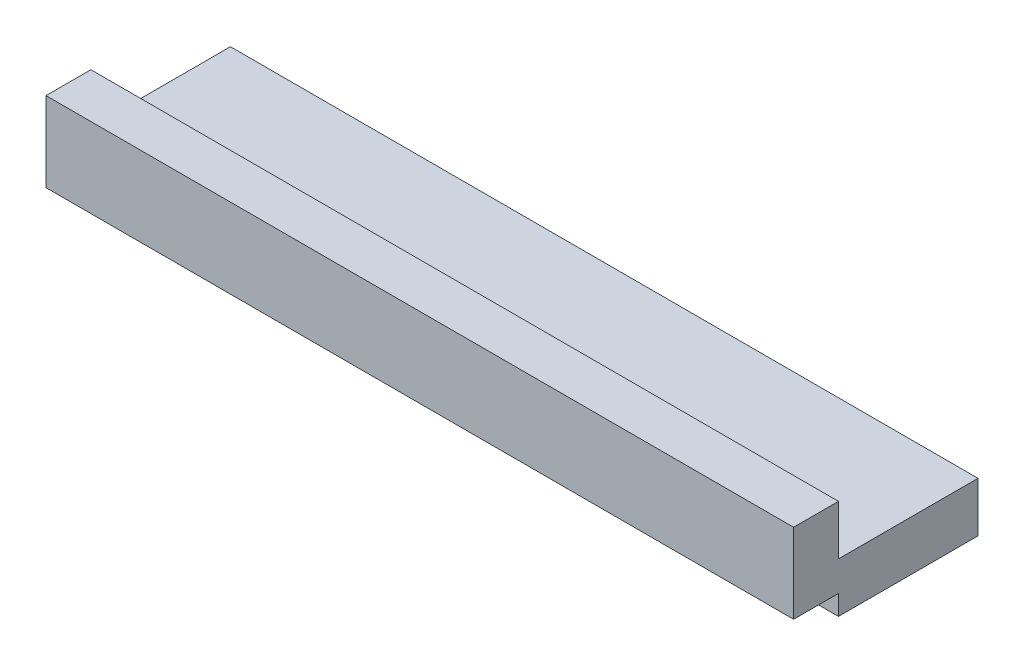
ISO-10303-21;
HEADER;
FILE_DESCRIPTION(('STEP AP214'),'2;1');
FILE_NAME('part.step','',(''),(''),'','','');
FILE_SCHEMA(('AUTOMOTIVE_DESIGN { 1 0 10303 214 1 1 1 1 }'));
ENDSEC;
DATA;
#1=APPLICATION_CONTEXT('core data for automotive mechanical design processes');
#2=APPLICATION_PROTOCOL_DEFINITION('international standard','automotive_design',2000,#1);
#3=PRODUCT_CONTEXT('',#1,'mechanical');
#4=PRODUCT('Part','Part','',(#3));
#5=PRODUCT_RELATED_PRODUCT_CATEGORY('part','',(#4));
#6=PRODUCT_DEFINITION_FORMATION('','',#4);
#7=PRODUCT_DEFINITION_CONTEXT('part definition',#1,'design');
#8=PRODUCT_DEFINITION('design','',#6,#7);
#9=PRODUCT_DEFINITION_SHAPE('','',#8);
#10=(LENGTH_UNIT() NAMED_UNIT(*) SI_UNIT(.MILLI.,.METRE.));
#11=(NAMED_UNIT(*) PLANE_ANGLE_UNIT() SI_UNIT($,.RADIAN.));
#12=(NAMED_UNIT(*) SI_UNIT($,.STERADIAN.) SOLID_ANGLE_UNIT());
#13=UNCERTAINTY_MEASURE_WITH_UNIT(LENGTH_MEASURE(1.E-05),#10,'distance_accuracy_value','');
#14=(GEOMETRIC_REPRESENTATION_CONTEXT(3) GLOBAL_UNCERTAINTY_ASSIGNED_CONTEXT((#13)) GLOBAL_UNIT_ASSIGNED_CONTEXT((#10,
#11,#12)) REPRESENTATION_CONTEXT('',''));
#15=CARTESIAN_POINT('',(0.,0.,0.));
#16=DIRECTION('',(0.,0.,1.));
#17=DIRECTION('',(1.,0.,0.));
#18=AXIS2_PLACEMENT_3D('',#15,#16,#17);
#19=CARTESIAN_POINT('',(0.,0.,-2.6939393939394));
#20=DIRECTION('',(0.,0.,1.));
#21=DIRECTION('',(1.,0.,0.));
#22=AXIS2_PLACEMENT_3D('',#19,#20,#21);
#23=PLANE('',#22);
#24=DIRECTION('',(-1.,0.,0.));
#25=VECTOR('',#24,1.);
#26=CARTESIAN_POINT('',(-27.7860606060606,0.,-2.6939393939394));
#27=LINE('',#26,#25);
#28=CARTESIAN_POINT('',(10.3139393939394,0.,-2.6939393939394));
#29=VERTEX_POINT('',#28);
#30=CARTESIAN_POINT('',(2.94793939393943,0.,-2.6939393939394));
#31=VERTEX_POINT('',#30);
#32=EDGE_CURVE('E119',#29,#31,#27,.T.);
#33=ORIENTED_EDGE('',*,*,#32,.T.);
#34=DIRECTION('',(0.,1.,0.));
#35=VECTOR('',#34,1.);
#36=CARTESIAN_POINT('',(2.94793939393943,-1.016,-2.6939393939394));
#37=LINE('',#36,#35);
#38=CARTESIAN_POINT('',(2.94793939393943,-1.016,-2.6939393939394));
#39=VERTEX_POINT('',#38);
#40=EDGE_CURVE('E125',#39,#31,#37,.T.);
#41=ORIENTED_EDGE('',*,*,#40,.F.);
#42=DIRECTION('',(-1.,0.,0.));
#43=VECTOR('',#42,1.);
#44=CARTESIAN_POINT('',(-27.7860606060606,-1.016,-2.6939393939394));
#45=LINE('',#44,#43);
#46=CARTESIAN_POINT('',(10.3139393939394,-1.016,-2.6939393939394));
#47=VERTEX_POINT('',#46);
#48=EDGE_CURVE('E181',#47,#39,#45,.T.);
#49=ORIENTED_EDGE('',*,*,#48,.F.);
#50=DIRECTION('',(0.,-1.,0.));
#51=VECTOR('',#50,1.);
#52=CARTESIAN_POINT('',(10.3139393939394,1.524,-2.6939393939394));
#53=LINE('',#52,#51);
#54=EDGE_CURVE('E133',#29,#47,#53,.T.);
#55=ORIENTED_EDGE('',*,*,#54,.F.);
#56=EDGE_LOOP('',(#33,#41,#49,#55));
#57=FACE_BOUND('',#56,.T.);
#58=ADVANCED_FACE('F35',(#57),#23,.T.);
#59=CARTESIAN_POINT('',(-27.7860606060606,4.064,-2.6939393939394));
#60=DIRECTION('',(0.,0.,1.));
#61=DIRECTION('',(1.,0.,0.));
#62=AXIS2_PLACEMENT_3D('',#59,#60,#61);
#63=PLANE('',#62);
#64=DIRECTION('',(1.,0.,0.));
#65=VECTOR('',#64,1.);
#66=CARTESIAN_POINT('',(-27.7860606060606,1.524,-2.6939393939394));
#67=LINE('',#66,#65);
#68=CARTESIAN_POINT('',(-27.7860606060606,1.524,-2.6939393939394));
#69=VERTEX_POINT('',#68);
#70=CARTESIAN_POINT('',(10.3139393939394,1.524,-2.6939393939394));
#71=VERTEX_POINT('',#70);
#72=EDGE_CURVE('E58',#69,#71,#67,.T.);
#73=ORIENTED_EDGE('',*,*,#72,.F.);
#74=DIRECTION('',(0.,-1.,0.));
#75=VECTOR('',#74,1.);
#76=CARTESIAN_POINT('',(-27.7860606060606,4.064,-2.6939393939394));
#77=LINE('',#76,#75);
#78=CARTESIAN_POINT('',(-27.7860606060606,4.064,-2.6939393939394));
#79=VERTEX_POINT('',#78);
#80=EDGE_CURVE('E144',#79,#69,#77,.T.);
#81=ORIENTED_EDGE('',*,*,#80,.F.);
#82=DIRECTION('',(-1.,0.,0.));
#83=VECTOR('',#82,1.);
#84=CARTESIAN_POINT('',(-27.7860606060606,4.064,-2.6939393939394));
#85=LINE('',#84,#83);
#86=CARTESIAN_POINT('',(10.3139393939394,4.064,-2.6939393939394));
#87=VERTEX_POINT('',#86);
#88=EDGE_CURVE('E147',#87,#79,#85,.T.);
#89=ORIENTED_EDGE('',*,*,#88,.F.);
#90=DIRECTION('',(0.,-1.,0.));
#91=VECTOR('',#90,1.);
#92=CARTESIAN_POINT('',(10.3139393939394,4.064,-2.6939393939394));
#93=LINE('',#92,#91);
#94=EDGE_CURVE('E146',#87,#71,#93,.T.);
#95=ORIENTED_EDGE('',*,*,#94,.T.);
#96=EDGE_LOOP('',(#73,#81,#89,#95));
#97=FACE_BOUND('',#96,.T.);
#98=ADVANCED_FACE('F214',(#97),#63,.F.);
#99=CARTESIAN_POINT('',(-27.7860606060606,4.064,-0.407939393939396));
#100=DIRECTION('',(1.,0.,0.));
#101=DIRECTION('',(0.,0.,-1.));
#102=AXIS2_PLACEMENT_3D('',#99,#100,#101);
#103=PLANE('',#102);
#104=DIRECTION('',(0.,0.,1.));
#105=VECTOR('',#104,1.);
#106=CARTESIAN_POINT('',(-27.7860606060606,-1.016,-9.8059393939394));
#107=LINE('',#106,#105);
#108=CARTESIAN_POINT('',(-27.7860606060606,-1.016,-9.8059393939394));
#109=VERTEX_POINT('',#108);
#110=CARTESIAN_POINT('',(-27.7860606060606,-1.016,-3.4559393939394));
#111=VERTEX_POINT('',#110);
#112=EDGE_CURVE('E178',#109,#111,#107,.T.);
#113=ORIENTED_EDGE('',*,*,#112,.T.);
#114=DIRECTION('',(0.,-1.,0.));
#115=VECTOR('',#114,1.);
#116=CARTESIAN_POINT('',(-27.7860606060606,-1.016,-3.4559393939394));
#117=LINE('',#116,#115);
#118=CARTESIAN_POINT('',(-27.7860606060606,0.,-3.4559393939394));
#119=VERTEX_POINT('',#118);
#120=EDGE_CURVE('E131',#119,#111,#117,.T.);
#121=ORIENTED_EDGE('',*,*,#120,.F.);
#122=DIRECTION('',(0.,0.,1.));
#123=VECTOR('',#122,1.);
#124=CARTESIAN_POINT('',(-27.7860606060606,0.,-0.407939393939396));
#125=LINE('',#124,#123);
#126=CARTESIAN_POINT('',(-27.7860606060606,0.,-0.407939393939396));
#127=VERTEX_POINT('',#126);
#128=EDGE_CURVE('E157',#119,#127,#125,.T.);
#129=ORIENTED_EDGE('',*,*,#128,.T.);
#130=DIRECTION('',(0.,-1.,0.));
#131=VECTOR('',#130,1.);
#132=CARTESIAN_POINT('',(-27.7860606060606,4.064,-0.407939393939396));
#133=LINE('',#132,#131);
#134=CARTESIAN_POINT('',(-27.7860606060606,4.064,-0.407939393939396));
#135=VERTEX_POINT('',#134);
#136=EDGE_CURVE('E11',#135,#127,#133,.T.);
#137=ORIENTED_EDGE('',*,*,#136,.F.);
#138=DIRECTION('',(0.,0.,1.));
#139=VECTOR('',#138,1.);
#140=CARTESIAN_POINT('',(-27.7860606060606,4.064,-0.407939393939396));
#141=LINE('',#140,#139);
#142=EDGE_CURVE('E134',#79,#135,#141,.T.);
#143=ORIENTED_EDGE('',*,*,#142,.F.);
#144=ORIENTED_EDGE('',*,*,#80,.T.);
#145=DIRECTION('',(0.,0.,1.));
#146=VECTOR('',#145,1.);
#147=CARTESIAN_POINT('',(-27.7860606060606,1.524,-9.8059393939394));
#148=LINE('',#147,#146);
#149=CARTESIAN_POINT('',(-27.7860606060606,1.524,-9.8059393939394));
#150=VERTEX_POINT('',#149);
#151=EDGE_CURVE('E164',#150,#69,#148,.T.);
#152=ORIENTED_EDGE('',*,*,#151,.F.);
#153=DIRECTION('',(0.,1.,0.));
#154=VECTOR('',#153,1.);
#155=CARTESIAN_POINT('',(-27.7860606060606,1.524,-9.8059393939394));
#156=LINE('',#155,#154);
#157=EDGE_CURVE('E183',#109,#150,#156,.T.);
#158=ORIENTED_EDGE('',*,*,#157,.F.);
#159=EDGE_LOOP('',(#113,#121,#129,#137,#143,#144,#152,#158));
#160=FACE_BOUND('',#159,.T.);
#161=ADVANCED_FACE('F37',(#160),#103,.F.);
#162=CARTESIAN_POINT('',(-27.7860606060606,4.064,-0.407939393939396));
#163=DIRECTION('',(0.,0.,-1.));
#164=DIRECTION('',(-1.,0.,0.));
#165=AXIS2_PLACEMENT_3D('',#162,#163,#164);
#166=PLANE('',#165);
#167=DIRECTION('',(1.,0.,0.));
#168=VECTOR('',#167,1.);
#169=CARTESIAN_POINT('',(-27.7860606060606,0.,-0.407939393939396));
#170=LINE('',#169,#168);
#171=CARTESIAN_POINT('',(10.3139393939394,0.,-0.407939393939396));
#172=VERTEX_POINT('',#171);
#173=EDGE_CURVE('E140',#127,#172,#170,.T.);
#174=ORIENTED_EDGE('',*,*,#173,.T.);
#175=DIRECTION('',(0.,-1.,0.));
#176=VECTOR('',#175,1.);
#177=CARTESIAN_POINT('',(10.3139393939394,4.064,-0.407939393939396));
#178=LINE('',#177,#176);
#179=CARTESIAN_POINT('',(10.3139393939394,4.064,-0.407939393939396));
#180=VERTEX_POINT('',#179);
#181=EDGE_CURVE('E43',#180,#172,#178,.T.);
#182=ORIENTED_EDGE('',*,*,#181,.F.);
#183=DIRECTION('',(1.,0.,0.));
#184=VECTOR('',#183,1.);
#185=CARTESIAN_POINT('',(-27.7860606060606,4.064,-0.407939393939396));
#186=LINE('',#185,#184);
#187=EDGE_CURVE('E138',#135,#180,#186,.T.);
#188=ORIENTED_EDGE('',*,*,#187,.F.);
#189=ORIENTED_EDGE('',*,*,#136,.T.);
#190=EDGE_LOOP('',(#174,#182,#188,#189));
#191=FACE_BOUND('',#190,.T.);
#192=ADVANCED_FACE('F159',(#191),#166,.F.);
#193=CARTESIAN_POINT('',(10.3139393939394,4.064,-0.407939393939396));
#194=DIRECTION('',(-1.,0.,0.));
#195=DIRECTION('',(0.,0.,1.));
#196=AXIS2_PLACEMENT_3D('',#193,#194,#195);
#197=PLANE('',#196);
#198=DIRECTION('',(0.,0.,-1.));
#199=VECTOR('',#198,1.);
#200=CARTESIAN_POINT('',(10.3139393939394,0.,-0.407939393939396));
#201=LINE('',#200,#199);
#202=EDGE_CURVE('E135',#172,#29,#201,.T.);
#203=ORIENTED_EDGE('',*,*,#202,.T.);
#204=ORIENTED_EDGE('',*,*,#54,.T.);
#205=DIRECTION('',(0.,0.,1.));
#206=VECTOR('',#205,1.);
#207=CARTESIAN_POINT('',(10.3139393939394,-1.016,-9.8059393939394));
#208=LINE('',#207,#206);
#209=CARTESIAN_POINT('',(10.3139393939394,-1.016,-9.8059393939394));
#210=VERTEX_POINT('',#209);
#211=EDGE_CURVE('E175',#210,#47,#208,.T.);
#212=ORIENTED_EDGE('',*,*,#211,.F.);
#213=DIRECTION('',(0.,-1.,0.));
#214=VECTOR('',#213,1.);
#215=CARTESIAN_POINT('',(10.3139393939394,1.524,-9.8059393939394));
#216=LINE('',#215,#214);
#217=CARTESIAN_POINT('',(10.3139393939394,1.524,-9.8059393939394));
#218=VERTEX_POINT('',#217);
#219=EDGE_CURVE('E188',#218,#210,#216,.T.);
#220=ORIENTED_EDGE('',*,*,#219,.F.);
#221=DIRECTION('',(0.,0.,1.));
#222=VECTOR('',#221,1.);
#223=CARTESIAN_POINT('',(10.3139393939394,1.524,-9.8059393939394));
#224=LINE('',#223,#222);
#225=EDGE_CURVE('E167',#218,#71,#224,.T.);
#226=ORIENTED_EDGE('',*,*,#225,.T.);
#227=ORIENTED_EDGE('',*,*,#94,.F.);
#228=DIRECTION('',(0.,0.,-1.));
#229=VECTOR('',#228,1.);
#230=CARTESIAN_POINT('',(10.3139393939394,4.064,-0.407939393939396));
#231=LINE('',#230,#229);
#232=EDGE_CURVE('E154',#180,#87,#231,.T.);
#233=ORIENTED_EDGE('',*,*,#232,.F.);
#234=ORIENTED_EDGE('',*,*,#181,.T.);
#235=EDGE_LOOP('',(#203,#204,#212,#220,#226,#227,#233,#234));
#236=FACE_BOUND('',#235,.T.);
#237=ADVANCED_FACE('F152',(#236),#197,.F.);
#238=CARTESIAN_POINT('',(0.,4.064,0.));
#239=DIRECTION('',(0.,-1.,0.));
#240=DIRECTION('',(0.,0.,-1.));
#241=AXIS2_PLACEMENT_3D('',#238,#239,#240);
#242=PLANE('',#241);
#243=ORIENTED_EDGE('',*,*,#142,.T.);
#244=ORIENTED_EDGE('',*,*,#187,.T.);
#245=ORIENTED_EDGE('',*,*,#232,.T.);
#246=ORIENTED_EDGE('',*,*,#88,.T.);
#247=EDGE_LOOP('',(#243,#244,#245,#246));
#248=FACE_BOUND('',#247,.T.);
#249=ADVANCED_FACE('F216',(#248),#242,.F.);
#250=CARTESIAN_POINT('',(0.,0.,0.));
#251=DIRECTION('',(0.,-1.,0.));
#252=DIRECTION('',(0.,0.,-1.));
#253=AXIS2_PLACEMENT_3D('',#250,#251,#252);
#254=PLANE('',#253);
#255=ORIENTED_EDGE('',*,*,#128,.F.);
#256=DIRECTION('',(-1.,0.,0.));
#257=VECTOR('',#256,1.);
#258=CARTESIAN_POINT('',(2.94793939393943,0.,-3.4559393939394));
#259=LINE('',#258,#257);
#260=CARTESIAN_POINT('',(2.94793939393943,0.,-3.4559393939394));
#261=VERTEX_POINT('',#260);
#262=EDGE_CURVE('E122',#261,#119,#259,.T.);
#263=ORIENTED_EDGE('',*,*,#262,.F.);
#264=DIRECTION('',(0.,0.,-1.));
#265=VECTOR('',#264,1.);
#266=CARTESIAN_POINT('',(2.94793939393943,0.,-2.6939393939394));
#267=LINE('',#266,#265);
#268=EDGE_CURVE('E115',#31,#261,#267,.T.);
#269=ORIENTED_EDGE('',*,*,#268,.F.);
#270=ORIENTED_EDGE('',*,*,#32,.F.);
#271=ORIENTED_EDGE('',*,*,#202,.F.);
#272=ORIENTED_EDGE('',*,*,#173,.F.);
#273=EDGE_LOOP('',(#255,#263,#269,#270,#271,#272));
#274=FACE_BOUND('',#273,.T.);
#275=ADVANCED_FACE('F116',(#274),#254,.T.);
#276=CARTESIAN_POINT('',(-27.7860606060606,1.524,-9.8059393939394));
#277=DIRECTION('',(0.,-1.,0.));
#278=DIRECTION('',(1.,0.,0.));
#279=AXIS2_PLACEMENT_3D('',#276,#277,#278);
#280=PLANE('',#279);
#281=ORIENTED_EDGE('',*,*,#72,.T.);
#282=ORIENTED_EDGE('',*,*,#225,.F.);
#283=DIRECTION('',(1.,0.,0.));
#284=VECTOR('',#283,1.);
#285=CARTESIAN_POINT('',(-27.7860606060606,1.524,-9.8059393939394));
#286=LINE('',#285,#284);
#287=EDGE_CURVE('E190',#150,#218,#286,.T.);
#288=ORIENTED_EDGE('',*,*,#287,.F.);
#289=ORIENTED_EDGE('',*,*,#151,.T.);
#290=EDGE_LOOP('',(#281,#282,#288,#289));
#291=FACE_BOUND('',#290,.T.);
#292=ADVANCED_FACE('F212',(#291),#280,.F.);
#293=CARTESIAN_POINT('',(-27.7860606060606,-1.016,-9.8059393939394));
#294=DIRECTION('',(0.,1.,0.));
#295=DIRECTION('',(-1.,0.,0.));
#296=AXIS2_PLACEMENT_3D('',#293,#294,#295);
#297=PLANE('',#296);
#298=DIRECTION('',(0.,0.,1.));
#299=VECTOR('',#298,1.);
#300=CARTESIAN_POINT('',(2.94793939393943,-1.016,-2.6939393939394));
#301=LINE('',#300,#299);
#302=CARTESIAN_POINT('',(2.94793939393943,-1.016,-3.4559393939394));
#303=VERTEX_POINT('',#302);
#304=EDGE_CURVE('E50',#303,#39,#301,.T.);
#305=ORIENTED_EDGE('',*,*,#304,.F.);
#306=DIRECTION('',(-1.,0.,0.));
#307=VECTOR('',#306,1.);
#308=CARTESIAN_POINT('',(2.94793939393943,-1.016,-3.4559393939394));
#309=LINE('',#308,#307);
#310=EDGE_CURVE('E186',#303,#111,#309,.T.);
#311=ORIENTED_EDGE('',*,*,#310,.T.);
#312=ORIENTED_EDGE('',*,*,#112,.F.);
#313=DIRECTION('',(-1.,0.,0.));
#314=VECTOR('',#313,1.);
#315=CARTESIAN_POINT('',(-27.7860606060606,-1.016,-9.8059393939394));
#316=LINE('',#315,#314);
#317=EDGE_CURVE('E180',#210,#109,#316,.T.);
#318=ORIENTED_EDGE('',*,*,#317,.F.);
#319=ORIENTED_EDGE('',*,*,#211,.T.);
#320=ORIENTED_EDGE('',*,*,#48,.T.);
#321=EDGE_LOOP('',(#305,#311,#312,#318,#319,#320));
#322=FACE_BOUND('',#321,.T.);
#323=ADVANCED_FACE('F201',(#322),#297,.F.);
#324=CARTESIAN_POINT('',(0.,0.,-9.8059393939394));
#325=DIRECTION('',(0.,0.,1.));
#326=DIRECTION('',(1.,0.,0.));
#327=AXIS2_PLACEMENT_3D('',#324,#325,#326);
#328=PLANE('',#327);
#329=ORIENTED_EDGE('',*,*,#157,.T.);
#330=ORIENTED_EDGE('',*,*,#287,.T.);
#331=ORIENTED_EDGE('',*,*,#219,.T.);
#332=ORIENTED_EDGE('',*,*,#317,.T.);
#333=EDGE_LOOP('',(#329,#330,#331,#332));
#334=FACE_BOUND('',#333,.T.);
#335=ADVANCED_FACE('F208',(#334),#328,.F.);
#336=CARTESIAN_POINT('',(2.94793939393943,-1.016,-3.4559393939394));
#337=DIRECTION('',(0.,0.,-1.));
#338=DIRECTION('',(-1.,0.,0.));
#339=AXIS2_PLACEMENT_3D('',#336,#337,#338);
#340=PLANE('',#339);
#341=ORIENTED_EDGE('',*,*,#120,.T.);
#342=ORIENTED_EDGE('',*,*,#310,.F.);
#343=DIRECTION('',(0.,-1.,0.));
#344=VECTOR('',#343,1.);
#345=CARTESIAN_POINT('',(2.94793939393943,-1.016,-3.4559393939394));
#346=LINE('',#345,#344);
#347=EDGE_CURVE('E124',#261,#303,#346,.T.);
#348=ORIENTED_EDGE('',*,*,#347,.F.);
#349=ORIENTED_EDGE('',*,*,#262,.T.);
#350=EDGE_LOOP('',(#341,#342,#348,#349));
#351=FACE_BOUND('',#350,.T.);
#352=ADVANCED_FACE('F253',(#351),#340,.F.);
#353=CARTESIAN_POINT('',(2.94793939393943,0.,0.));
#354=DIRECTION('',(-1.,0.,0.));
#355=DIRECTION('',(0.,0.,1.));
#356=AXIS2_PLACEMENT_3D('',#353,#354,#355);
#357=PLANE('',#356);
#358=ORIENTED_EDGE('',*,*,#40,.T.);
#359=ORIENTED_EDGE('',*,*,#268,.T.);
#360=ORIENTED_EDGE('',*,*,#347,.T.);
#361=ORIENTED_EDGE('',*,*,#304,.T.);
#362=EDGE_LOOP('',(#358,#359,#360,#361));
#363=FACE_BOUND('',#362,.T.);
#364=ADVANCED_FACE('F127',(#363),#357,.T.);
#365=CLOSED_SHELL('',(#58,#98,#161,#192,#237,#249,#275,#292,#323,#335,#352,#364));
#366=MANIFOLD_SOLID_BREP('B2',#365);
#367=ADVANCED_BREP_SHAPE_REPRESENTATION('',(#18,#366),#14);
#368=SHAPE_DEFINITION_REPRESENTATION(#9,#367);
ENDSEC;
END-ISO-10303-21;
